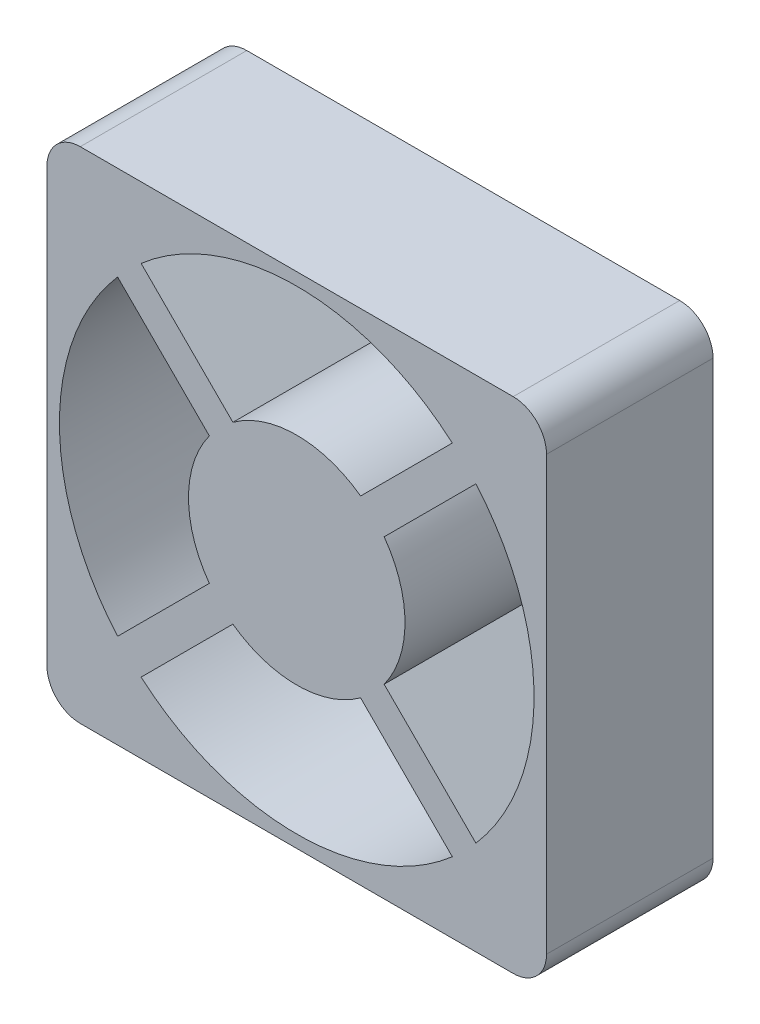
ISO-10303-21;
HEADER;
FILE_DESCRIPTION(('STEP AP214'),'2;1');
FILE_NAME('part.step','',(''),(''),'','','');
FILE_SCHEMA(('AUTOMOTIVE_DESIGN { 1 0 10303 214 1 1 1 1 }'));
ENDSEC;
DATA;
#1=APPLICATION_CONTEXT('core data for automotive mechanical design processes');
#2=APPLICATION_PROTOCOL_DEFINITION('international standard','automotive_design',2000,#1);
#3=PRODUCT_CONTEXT('',#1,'mechanical');
#4=PRODUCT('Part','Part','',(#3));
#5=PRODUCT_RELATED_PRODUCT_CATEGORY('part','',(#4));
#6=PRODUCT_DEFINITION_FORMATION('','',#4);
#7=PRODUCT_DEFINITION_CONTEXT('part definition',#1,'design');
#8=PRODUCT_DEFINITION('design','',#6,#7);
#9=PRODUCT_DEFINITION_SHAPE('','',#8);
#10=(LENGTH_UNIT() NAMED_UNIT(*) SI_UNIT(.MILLI.,.METRE.));
#11=(NAMED_UNIT(*) PLANE_ANGLE_UNIT() SI_UNIT($,.RADIAN.));
#12=(NAMED_UNIT(*) SI_UNIT($,.STERADIAN.) SOLID_ANGLE_UNIT());
#13=UNCERTAINTY_MEASURE_WITH_UNIT(LENGTH_MEASURE(1.E-05),#10,'distance_accuracy_value','');
#14=(GEOMETRIC_REPRESENTATION_CONTEXT(3) GLOBAL_UNCERTAINTY_ASSIGNED_CONTEXT((#13)) GLOBAL_UNIT_ASSIGNED_CONTEXT((#10,
#11,#12)) REPRESENTATION_CONTEXT('',''));
#15=CARTESIAN_POINT('',(0.,0.,0.));
#16=DIRECTION('',(0.,0.,1.));
#17=DIRECTION('',(1.,0.,0.));
#18=AXIS2_PLACEMENT_3D('',#15,#16,#17);
#19=CARTESIAN_POINT('',(0.,0.,10.));
#20=DIRECTION('',(0.,0.,-1.));
#21=DIRECTION('',(-1.,0.,0.));
#22=AXIS2_PLACEMENT_3D('',#19,#20,#21);
#23=CYLINDRICAL_SURFACE('',#22,14.25);
#24=CARTESIAN_POINT('',(0.,0.,0.));
#25=DIRECTION('',(0.,0.,1.));
#26=DIRECTION('',(1.,0.,0.));
#27=AXIS2_PLACEMENT_3D('',#24,#25,#26);
#28=CIRCLE('',#27,14.25);
#29=CARTESIAN_POINT('',(-10.7585370276739,9.34432346530076,0.));
#30=VERTEX_POINT('',#29);
#31=CARTESIAN_POINT('',(-10.7585370276739,-9.34432346530077,0.));
#32=VERTEX_POINT('',#31);
#33=EDGE_CURVE('E288',#30,#32,#28,.T.);
#34=ORIENTED_EDGE('',*,*,#33,.F.);
#35=DIRECTION('',(0.,0.,-1.));
#36=VECTOR('',#35,1.);
#37=CARTESIAN_POINT('',(-10.7585370276739,9.34432346530076,10.));
#38=LINE('',#37,#36);
#39=CARTESIAN_POINT('',(-10.7585370276739,9.34432346530076,10.));
#40=VERTEX_POINT('',#39);
#41=EDGE_CURVE('E233',#40,#30,#38,.T.);
#42=ORIENTED_EDGE('',*,*,#41,.F.);
#43=CARTESIAN_POINT('',(0.,0.,10.));
#44=DIRECTION('',(0.,0.,1.));
#45=DIRECTION('',(1.,0.,0.));
#46=AXIS2_PLACEMENT_3D('',#43,#44,#45);
#47=CIRCLE('',#46,14.25);
#48=CARTESIAN_POINT('',(-10.7585370276739,-9.34432346530077,10.));
#49=VERTEX_POINT('',#48);
#50=EDGE_CURVE('E467',#40,#49,#47,.T.);
#51=ORIENTED_EDGE('',*,*,#50,.T.);
#52=DIRECTION('',(0.,0.,-1.));
#53=VECTOR('',#52,1.);
#54=CARTESIAN_POINT('',(-10.7585370276739,-9.34432346530077,10.));
#55=LINE('',#54,#53);
#56=EDGE_CURVE('E304',#49,#32,#55,.T.);
#57=ORIENTED_EDGE('',*,*,#56,.T.);
#58=EDGE_LOOP('',(#34,#42,#51,#57));
#59=FACE_BOUND('',#58,.T.);
#60=ADVANCED_FACE('F33',(#59),#23,.F.);
#61=CARTESIAN_POINT('',(-0.707106781186549,-0.707106781186549,10.));
#62=DIRECTION('',(0.707106781186548,0.707106781186548,0.));
#63=DIRECTION('',(-0.707106781186548,0.707106781186548,0.));
#64=AXIS2_PLACEMENT_3D('',#61,#62,#63);
#65=PLANE('',#64);
#66=DIRECTION('',(0.707106781186548,-0.707106781186548,0.));
#67=VECTOR('',#66,1.);
#68=CARTESIAN_POINT('',(-0.707106781186549,-0.707106781186549,0.));
#69=LINE('',#68,#67);
#70=CARTESIAN_POINT('',(-5.24858231233279,3.83436874995969,0.));
#71=VERTEX_POINT('',#70);
#72=EDGE_CURVE('E296',#30,#71,#69,.T.);
#73=ORIENTED_EDGE('',*,*,#72,.T.);
#74=DIRECTION('',(0.,0.,-1.));
#75=VECTOR('',#74,1.);
#76=CARTESIAN_POINT('',(-5.24858231233279,3.83436874995969,10.));
#77=LINE('',#76,#75);
#78=CARTESIAN_POINT('',(-5.24858231233279,3.83436874995969,10.));
#79=VERTEX_POINT('',#78);
#80=EDGE_CURVE('E309',#79,#71,#77,.T.);
#81=ORIENTED_EDGE('',*,*,#80,.F.);
#82=DIRECTION('',(0.707106781186548,-0.707106781186548,0.));
#83=VECTOR('',#82,1.);
#84=CARTESIAN_POINT('',(-0.707106781186549,-0.707106781186549,10.));
#85=LINE('',#84,#83);
#86=EDGE_CURVE('E470',#40,#79,#85,.T.);
#87=ORIENTED_EDGE('',*,*,#86,.F.);
#88=ORIENTED_EDGE('',*,*,#41,.T.);
#89=EDGE_LOOP('',(#73,#81,#87,#88));
#90=FACE_BOUND('',#89,.T.);
#91=ADVANCED_FACE('F386',(#90),#65,.F.);
#92=CARTESIAN_POINT('',(0.,0.,10.));
#93=DIRECTION('',(0.,0.,-1.));
#94=DIRECTION('',(-1.,0.,0.));
#95=AXIS2_PLACEMENT_3D('',#92,#93,#94);
#96=CYLINDRICAL_SURFACE('',#95,6.5);
#97=CARTESIAN_POINT('',(0.,0.,0.));
#98=DIRECTION('',(0.,0.,1.));
#99=DIRECTION('',(1.,0.,0.));
#100=AXIS2_PLACEMENT_3D('',#97,#98,#99);
#101=CIRCLE('',#100,6.5);
#102=CARTESIAN_POINT('',(-5.24858231233279,-3.83436874995969,0.));
#103=VERTEX_POINT('',#102);
#104=EDGE_CURVE('E299',#71,#103,#101,.T.);
#105=ORIENTED_EDGE('',*,*,#104,.T.);
#106=DIRECTION('',(0.,0.,-1.));
#107=VECTOR('',#106,1.);
#108=CARTESIAN_POINT('',(-5.24858231233279,-3.83436874995969,10.));
#109=LINE('',#108,#107);
#110=CARTESIAN_POINT('',(-5.24858231233279,-3.83436874995969,10.));
#111=VERTEX_POINT('',#110);
#112=EDGE_CURVE('E306',#111,#103,#109,.T.);
#113=ORIENTED_EDGE('',*,*,#112,.F.);
#114=CARTESIAN_POINT('',(0.,0.,10.));
#115=DIRECTION('',(0.,0.,1.));
#116=DIRECTION('',(1.,0.,0.));
#117=AXIS2_PLACEMENT_3D('',#114,#115,#116);
#118=CIRCLE('',#117,6.5);
#119=EDGE_CURVE('E473',#79,#111,#118,.T.);
#120=ORIENTED_EDGE('',*,*,#119,.F.);
#121=ORIENTED_EDGE('',*,*,#80,.T.);
#122=EDGE_LOOP('',(#105,#113,#120,#121));
#123=FACE_BOUND('',#122,.T.);
#124=ADVANCED_FACE('F392',(#123),#96,.T.);
#125=CARTESIAN_POINT('',(15.,0.,10.));
#126=DIRECTION('',(1.,0.,0.));
#127=DIRECTION('',(0.,1.,0.));
#128=AXIS2_PLACEMENT_3D('',#125,#126,#127);
#129=PLANE('',#128);
#130=DIRECTION('',(0.,-1.,0.));
#131=VECTOR('',#130,1.);
#132=CARTESIAN_POINT('',(15.,0.,10.));
#133=LINE('',#132,#131);
#134=CARTESIAN_POINT('',(15.,13.,10.));
#135=VERTEX_POINT('',#134);
#136=CARTESIAN_POINT('',(15.,-13.,10.));
#137=VERTEX_POINT('',#136);
#138=EDGE_CURVE('E274',#135,#137,#133,.T.);
#139=ORIENTED_EDGE('',*,*,#138,.T.);
#140=DIRECTION('',(0.,0.,-1.));
#141=VECTOR('',#140,1.);
#142=CARTESIAN_POINT('',(15.,-13.,0.));
#143=LINE('',#142,#141);
#144=CARTESIAN_POINT('',(15.,-13.,0.));
#145=VERTEX_POINT('',#144);
#146=EDGE_CURVE('E232',#137,#145,#143,.T.);
#147=ORIENTED_EDGE('',*,*,#146,.T.);
#148=DIRECTION('',(0.,-1.,0.));
#149=VECTOR('',#148,1.);
#150=CARTESIAN_POINT('',(15.,0.,0.));
#151=LINE('',#150,#149);
#152=CARTESIAN_POINT('',(15.,13.,0.));
#153=VERTEX_POINT('',#152);
#154=EDGE_CURVE('E290',#153,#145,#151,.T.);
#155=ORIENTED_EDGE('',*,*,#154,.F.);
#156=DIRECTION('',(0.,0.,-1.));
#157=VECTOR('',#156,1.);
#158=CARTESIAN_POINT('',(15.,13.,10.));
#159=LINE('',#158,#157);
#160=EDGE_CURVE('E230',#153,#135,#159,.F.);
#161=ORIENTED_EDGE('',*,*,#160,.T.);
#162=EDGE_LOOP('',(#139,#147,#155,#161));
#163=FACE_BOUND('',#162,.T.);
#164=ADVANCED_FACE('F372',(#163),#129,.T.);
#165=CARTESIAN_POINT('',(0.,15.,10.));
#166=DIRECTION('',(0.,1.,0.));
#167=DIRECTION('',(0.,0.,1.));
#168=AXIS2_PLACEMENT_3D('',#165,#166,#167);
#169=PLANE('',#168);
#170=DIRECTION('',(1.,0.,0.));
#171=VECTOR('',#170,1.);
#172=CARTESIAN_POINT('',(0.,15.,10.));
#173=LINE('',#172,#171);
#174=CARTESIAN_POINT('',(-13.,15.,10.));
#175=VERTEX_POINT('',#174);
#176=CARTESIAN_POINT('',(13.,15.,10.));
#177=VERTEX_POINT('',#176);
#178=EDGE_CURVE('E264',#175,#177,#173,.T.);
#179=ORIENTED_EDGE('',*,*,#178,.T.);
#180=DIRECTION('',(0.,0.,-1.));
#181=VECTOR('',#180,1.);
#182=CARTESIAN_POINT('',(13.,15.,10.));
#183=LINE('',#182,#181);
#184=CARTESIAN_POINT('',(13.,15.,0.));
#185=VERTEX_POINT('',#184);
#186=EDGE_CURVE('E11',#177,#185,#183,.T.);
#187=ORIENTED_EDGE('',*,*,#186,.T.);
#188=DIRECTION('',(1.,0.,0.));
#189=VECTOR('',#188,1.);
#190=CARTESIAN_POINT('',(0.,15.,0.));
#191=LINE('',#190,#189);
#192=CARTESIAN_POINT('',(-13.,15.,0.));
#193=VERTEX_POINT('',#192);
#194=EDGE_CURVE('E267',#193,#185,#191,.T.);
#195=ORIENTED_EDGE('',*,*,#194,.F.);
#196=DIRECTION('',(0.,0.,-1.));
#197=VECTOR('',#196,1.);
#198=CARTESIAN_POINT('',(-13.,15.,10.));
#199=LINE('',#198,#197);
#200=EDGE_CURVE('E41',#193,#175,#199,.F.);
#201=ORIENTED_EDGE('',*,*,#200,.T.);
#202=EDGE_LOOP('',(#179,#187,#195,#201));
#203=FACE_BOUND('',#202,.T.);
#204=ADVANCED_FACE('F263',(#203),#169,.T.);
#205=CARTESIAN_POINT('',(-15.,0.,10.));
#206=DIRECTION('',(1.,0.,0.));
#207=DIRECTION('',(0.,1.,0.));
#208=AXIS2_PLACEMENT_3D('',#205,#206,#207);
#209=PLANE('',#208);
#210=DIRECTION('',(0.,-1.,0.));
#211=VECTOR('',#210,1.);
#212=CARTESIAN_POINT('',(-15.,0.,0.));
#213=LINE('',#212,#211);
#214=CARTESIAN_POINT('',(-15.,13.,0.));
#215=VERTEX_POINT('',#214);
#216=CARTESIAN_POINT('',(-15.,-13.,0.));
#217=VERTEX_POINT('',#216);
#218=EDGE_CURVE('E279',#215,#217,#213,.T.);
#219=ORIENTED_EDGE('',*,*,#218,.T.);
#220=DIRECTION('',(0.,0.,-1.));
#221=VECTOR('',#220,1.);
#222=CARTESIAN_POINT('',(-15.,-13.,10.));
#223=LINE('',#222,#221);
#224=CARTESIAN_POINT('',(-15.,-13.,10.));
#225=VERTEX_POINT('',#224);
#226=EDGE_CURVE('E48',#217,#225,#223,.F.);
#227=ORIENTED_EDGE('',*,*,#226,.T.);
#228=DIRECTION('',(0.,-1.,0.));
#229=VECTOR('',#228,1.);
#230=CARTESIAN_POINT('',(-15.,0.,10.));
#231=LINE('',#230,#229);
#232=CARTESIAN_POINT('',(-15.,13.,10.));
#233=VERTEX_POINT('',#232);
#234=EDGE_CURVE('E273',#233,#225,#231,.T.);
#235=ORIENTED_EDGE('',*,*,#234,.F.);
#236=DIRECTION('',(0.,0.,-1.));
#237=VECTOR('',#236,1.);
#238=CARTESIAN_POINT('',(-15.,13.,0.));
#239=LINE('',#238,#237);
#240=EDGE_CURVE('E256',#233,#215,#239,.T.);
#241=ORIENTED_EDGE('',*,*,#240,.T.);
#242=EDGE_LOOP('',(#219,#227,#235,#241));
#243=FACE_BOUND('',#242,.T.);
#244=ADVANCED_FACE('F278',(#243),#209,.F.);
#245=CARTESIAN_POINT('',(0.,0.,10.));
#246=DIRECTION('',(0.,0.,-1.));
#247=DIRECTION('',(-1.,0.,0.));
#248=AXIS2_PLACEMENT_3D('',#245,#246,#247);
#249=CYLINDRICAL_SURFACE('',#248,6.5);
#250=CARTESIAN_POINT('',(0.,0.,0.));
#251=DIRECTION('',(0.,0.,1.));
#252=DIRECTION('',(1.,0.,0.));
#253=AXIS2_PLACEMENT_3D('',#250,#251,#252);
#254=CIRCLE('',#253,6.5);
#255=CARTESIAN_POINT('',(-3.83436874995969,-5.24858231233279,0.));
#256=VERTEX_POINT('',#255);
#257=CARTESIAN_POINT('',(3.83436874995969,-5.24858231233279,0.));
#258=VERTEX_POINT('',#257);
#259=EDGE_CURVE('E358',#256,#258,#254,.T.);
#260=ORIENTED_EDGE('',*,*,#259,.T.);
#261=DIRECTION('',(0.,0.,-1.));
#262=VECTOR('',#261,1.);
#263=CARTESIAN_POINT('',(3.83436874995969,-5.24858231233279,10.));
#264=LINE('',#263,#262);
#265=CARTESIAN_POINT('',(3.83436874995969,-5.24858231233279,10.));
#266=VERTEX_POINT('',#265);
#267=EDGE_CURVE('E307',#266,#258,#264,.T.);
#268=ORIENTED_EDGE('',*,*,#267,.F.);
#269=CARTESIAN_POINT('',(0.,0.,10.));
#270=DIRECTION('',(0.,0.,1.));
#271=DIRECTION('',(1.,0.,0.));
#272=AXIS2_PLACEMENT_3D('',#269,#270,#271);
#273=CIRCLE('',#272,6.5);
#274=CARTESIAN_POINT('',(-3.83436874995969,-5.24858231233279,10.));
#275=VERTEX_POINT('',#274);
#276=EDGE_CURVE('E737',#275,#266,#273,.T.);
#277=ORIENTED_EDGE('',*,*,#276,.F.);
#278=DIRECTION('',(0.,0.,-1.));
#279=VECTOR('',#278,1.);
#280=CARTESIAN_POINT('',(-3.83436874995969,-5.24858231233279,10.));
#281=LINE('',#280,#279);
#282=EDGE_CURVE('E313',#275,#256,#281,.T.);
#283=ORIENTED_EDGE('',*,*,#282,.T.);
#284=EDGE_LOOP('',(#260,#268,#277,#283));
#285=FACE_BOUND('',#284,.T.);
#286=ADVANCED_FACE('F405',(#285),#249,.T.);
#287=CARTESIAN_POINT('',(-0.707106781186549,-0.707106781186549,10.));
#288=DIRECTION('',(0.707106781186548,0.707106781186548,0.));
#289=DIRECTION('',(-0.707106781186548,0.707106781186548,0.));
#290=AXIS2_PLACEMENT_3D('',#287,#288,#289);
#291=PLANE('',#290);
#292=DIRECTION('',(0.707106781186548,-0.707106781186548,0.));
#293=VECTOR('',#292,1.);
#294=CARTESIAN_POINT('',(-0.707106781186549,-0.707106781186549,0.));
#295=LINE('',#294,#293);
#296=CARTESIAN_POINT('',(9.34432346530076,-10.7585370276739,0.));
#297=VERTEX_POINT('',#296);
#298=EDGE_CURVE('E361',#258,#297,#295,.T.);
#299=ORIENTED_EDGE('',*,*,#298,.T.);
#300=DIRECTION('',(0.,0.,-1.));
#301=VECTOR('',#300,1.);
#302=CARTESIAN_POINT('',(9.34432346530076,-10.7585370276739,10.));
#303=LINE('',#302,#301);
#304=CARTESIAN_POINT('',(9.34432346530076,-10.7585370276739,10.));
#305=VERTEX_POINT('',#304);
#306=EDGE_CURVE('E319',#305,#297,#303,.T.);
#307=ORIENTED_EDGE('',*,*,#306,.F.);
#308=DIRECTION('',(0.707106781186548,-0.707106781186548,0.));
#309=VECTOR('',#308,1.);
#310=CARTESIAN_POINT('',(-0.707106781186549,-0.707106781186549,10.));
#311=LINE('',#310,#309);
#312=EDGE_CURVE('E735',#266,#305,#311,.T.);
#313=ORIENTED_EDGE('',*,*,#312,.F.);
#314=ORIENTED_EDGE('',*,*,#267,.T.);
#315=EDGE_LOOP('',(#299,#307,#313,#314));
#316=FACE_BOUND('',#315,.T.);
#317=ADVANCED_FACE('F418',(#316),#291,.F.);
#318=CARTESIAN_POINT('',(0.,0.,10.));
#319=DIRECTION('',(0.,0.,-1.));
#320=DIRECTION('',(-1.,0.,0.));
#321=AXIS2_PLACEMENT_3D('',#318,#319,#320);
#322=CYLINDRICAL_SURFACE('',#321,14.25);
#323=CARTESIAN_POINT('',(0.,0.,0.));
#324=DIRECTION('',(0.,0.,1.));
#325=DIRECTION('',(1.,0.,0.));
#326=AXIS2_PLACEMENT_3D('',#323,#324,#325);
#327=CIRCLE('',#326,14.25);
#328=CARTESIAN_POINT('',(-9.34432346530077,-10.7585370276739,0.));
#329=VERTEX_POINT('',#328);
#330=EDGE_CURVE('E364',#329,#297,#327,.T.);
#331=ORIENTED_EDGE('',*,*,#330,.F.);
#332=DIRECTION('',(0.,0.,-1.));
#333=VECTOR('',#332,1.);
#334=CARTESIAN_POINT('',(-9.34432346530077,-10.7585370276739,10.));
#335=LINE('',#334,#333);
#336=CARTESIAN_POINT('',(-9.34432346530077,-10.7585370276739,10.));
#337=VERTEX_POINT('',#336);
#338=EDGE_CURVE('E316',#337,#329,#335,.T.);
#339=ORIENTED_EDGE('',*,*,#338,.F.);
#340=CARTESIAN_POINT('',(0.,0.,10.));
#341=DIRECTION('',(0.,0.,1.));
#342=DIRECTION('',(1.,0.,0.));
#343=AXIS2_PLACEMENT_3D('',#340,#341,#342);
#344=CIRCLE('',#343,14.25);
#345=EDGE_CURVE('E461',#337,#305,#344,.T.);
#346=ORIENTED_EDGE('',*,*,#345,.T.);
#347=ORIENTED_EDGE('',*,*,#306,.T.);
#348=EDGE_LOOP('',(#331,#339,#346,#347));
#349=FACE_BOUND('',#348,.T.);
#350=ADVANCED_FACE('F414',(#349),#322,.F.);
#351=CARTESIAN_POINT('',(-0.707106781186548,0.707106781186548,10.));
#352=DIRECTION('',(-0.707106781186548,0.707106781186548,0.));
#353=DIRECTION('',(-0.707106781186548,-0.707106781186548,0.));
#354=AXIS2_PLACEMENT_3D('',#351,#352,#353);
#355=PLANE('',#354);
#356=DIRECTION('',(0.707106781186548,0.707106781186548,0.));
#357=VECTOR('',#356,1.);
#358=CARTESIAN_POINT('',(-0.707106781186548,0.707106781186548,0.));
#359=LINE('',#358,#357);
#360=CARTESIAN_POINT('',(3.83436874995969,5.24858231233278,0.));
#361=VERTEX_POINT('',#360);
#362=CARTESIAN_POINT('',(9.34432346530076,10.7585370276739,0.));
#363=VERTEX_POINT('',#362);
#364=EDGE_CURVE('E343',#361,#363,#359,.T.);
#365=ORIENTED_EDGE('',*,*,#364,.F.);
#366=DIRECTION('',(0.,0.,-1.));
#367=VECTOR('',#366,1.);
#368=CARTESIAN_POINT('',(3.83436874995969,5.24858231233278,10.));
#369=LINE('',#368,#367);
#370=CARTESIAN_POINT('',(3.83436874995969,5.24858231233278,10.));
#371=VERTEX_POINT('',#370);
#372=EDGE_CURVE('E317',#371,#361,#369,.T.);
#373=ORIENTED_EDGE('',*,*,#372,.F.);
#374=DIRECTION('',(0.707106781186548,0.707106781186548,0.));
#375=VECTOR('',#374,1.);
#376=CARTESIAN_POINT('',(-0.707106781186548,0.707106781186548,10.));
#377=LINE('',#376,#375);
#378=CARTESIAN_POINT('',(9.34432346530076,10.7585370276739,10.));
#379=VERTEX_POINT('',#378);
#380=EDGE_CURVE('E748',#371,#379,#377,.T.);
#381=ORIENTED_EDGE('',*,*,#380,.T.);
#382=DIRECTION('',(0.,0.,-1.));
#383=VECTOR('',#382,1.);
#384=CARTESIAN_POINT('',(9.34432346530076,10.7585370276739,10.));
#385=LINE('',#384,#383);
#386=EDGE_CURVE('E222',#379,#363,#385,.T.);
#387=ORIENTED_EDGE('',*,*,#386,.T.);
#388=EDGE_LOOP('',(#365,#373,#381,#387));
#389=FACE_BOUND('',#388,.T.);
#390=ADVANCED_FACE('F417',(#389),#355,.T.);
#391=CARTESIAN_POINT('',(0.,0.,10.));
#392=DIRECTION('',(0.,0.,-1.));
#393=DIRECTION('',(-1.,0.,0.));
#394=AXIS2_PLACEMENT_3D('',#391,#392,#393);
#395=CYLINDRICAL_SURFACE('',#394,6.5);
#396=CARTESIAN_POINT('',(0.,0.,0.));
#397=DIRECTION('',(0.,0.,1.));
#398=DIRECTION('',(1.,0.,0.));
#399=AXIS2_PLACEMENT_3D('',#396,#397,#398);
#400=CIRCLE('',#399,6.5);
#401=CARTESIAN_POINT('',(-3.83436874995969,5.24858231233279,0.));
#402=VERTEX_POINT('',#401);
#403=EDGE_CURVE('E346',#361,#402,#400,.T.);
#404=ORIENTED_EDGE('',*,*,#403,.T.);
#405=DIRECTION('',(0.,0.,-1.));
#406=VECTOR('',#405,1.);
#407=CARTESIAN_POINT('',(-3.83436874995969,5.24858231233279,10.));
#408=LINE('',#407,#406);
#409=CARTESIAN_POINT('',(-3.83436874995969,5.24858231233279,10.));
#410=VERTEX_POINT('',#409);
#411=EDGE_CURVE('E324',#410,#402,#408,.T.);
#412=ORIENTED_EDGE('',*,*,#411,.F.);
#413=CARTESIAN_POINT('',(0.,0.,10.));
#414=DIRECTION('',(0.,0.,1.));
#415=DIRECTION('',(1.,0.,0.));
#416=AXIS2_PLACEMENT_3D('',#413,#414,#415);
#417=CIRCLE('',#416,6.5);
#418=EDGE_CURVE('E746',#371,#410,#417,.T.);
#419=ORIENTED_EDGE('',*,*,#418,.F.);
#420=ORIENTED_EDGE('',*,*,#372,.T.);
#421=EDGE_LOOP('',(#404,#412,#419,#420));
#422=FACE_BOUND('',#421,.T.);
#423=ADVANCED_FACE('F432',(#422),#395,.T.);
#424=CARTESIAN_POINT('',(0.707106781186547,0.707106781186547,10.));
#425=DIRECTION('',(0.707106781186548,0.707106781186548,0.));
#426=DIRECTION('',(-0.707106781186548,0.707106781186548,0.));
#427=AXIS2_PLACEMENT_3D('',#424,#425,#426);
#428=PLANE('',#427);
#429=DIRECTION('',(0.707106781186548,-0.707106781186548,0.));
#430=VECTOR('',#429,1.);
#431=CARTESIAN_POINT('',(0.707106781186547,0.707106781186547,0.));
#432=LINE('',#431,#430);
#433=CARTESIAN_POINT('',(-9.34432346530077,10.7585370276739,0.));
#434=VERTEX_POINT('',#433);
#435=EDGE_CURVE('E352',#434,#402,#432,.T.);
#436=ORIENTED_EDGE('',*,*,#435,.F.);
#437=DIRECTION('',(0.,0.,-1.));
#438=VECTOR('',#437,1.);
#439=CARTESIAN_POINT('',(-9.34432346530077,10.7585370276739,10.));
#440=LINE('',#439,#438);
#441=CARTESIAN_POINT('',(-9.34432346530077,10.7585370276739,10.));
#442=VERTEX_POINT('',#441);
#443=EDGE_CURVE('E224',#442,#434,#440,.T.);
#444=ORIENTED_EDGE('',*,*,#443,.F.);
#445=DIRECTION('',(0.707106781186548,-0.707106781186548,0.));
#446=VECTOR('',#445,1.);
#447=CARTESIAN_POINT('',(0.707106781186547,0.707106781186547,10.));
#448=LINE('',#447,#446);
#449=EDGE_CURVE('E743',#442,#410,#448,.T.);
#450=ORIENTED_EDGE('',*,*,#449,.T.);
#451=ORIENTED_EDGE('',*,*,#411,.T.);
#452=EDGE_LOOP('',(#436,#444,#450,#451));
#453=FACE_BOUND('',#452,.T.);
#454=ADVANCED_FACE('F429',(#453),#428,.T.);
#455=CARTESIAN_POINT('',(0.,0.,10.));
#456=DIRECTION('',(0.,0.,-1.));
#457=DIRECTION('',(-1.,0.,0.));
#458=AXIS2_PLACEMENT_3D('',#455,#456,#457);
#459=CYLINDRICAL_SURFACE('',#458,6.5);
#460=CARTESIAN_POINT('',(0.,0.,0.));
#461=DIRECTION('',(0.,0.,1.));
#462=DIRECTION('',(1.,0.,0.));
#463=AXIS2_PLACEMENT_3D('',#460,#461,#462);
#464=CIRCLE('',#463,6.5);
#465=CARTESIAN_POINT('',(5.24858231233278,-3.83436874995969,0.));
#466=VERTEX_POINT('',#465);
#467=CARTESIAN_POINT('',(5.24858231233278,3.83436874995969,0.));
#468=VERTEX_POINT('',#467);
#469=EDGE_CURVE('E221',#466,#468,#464,.T.);
#470=ORIENTED_EDGE('',*,*,#469,.T.);
#471=DIRECTION('',(0.,0.,-1.));
#472=VECTOR('',#471,1.);
#473=CARTESIAN_POINT('',(5.24858231233278,3.83436874995969,10.));
#474=LINE('',#473,#472);
#475=CARTESIAN_POINT('',(5.24858231233278,3.83436874995969,10.));
#476=VERTEX_POINT('',#475);
#477=EDGE_CURVE('E201',#476,#468,#474,.T.);
#478=ORIENTED_EDGE('',*,*,#477,.F.);
#479=CARTESIAN_POINT('',(0.,0.,10.));
#480=DIRECTION('',(0.,0.,1.));
#481=DIRECTION('',(1.,0.,0.));
#482=AXIS2_PLACEMENT_3D('',#479,#480,#481);
#483=CIRCLE('',#482,6.5);
#484=CARTESIAN_POINT('',(5.24858231233278,-3.83436874995969,10.));
#485=VERTEX_POINT('',#484);
#486=EDGE_CURVE('E208',#485,#476,#483,.T.);
#487=ORIENTED_EDGE('',*,*,#486,.F.);
#488=DIRECTION('',(0.,0.,-1.));
#489=VECTOR('',#488,1.);
#490=CARTESIAN_POINT('',(5.24858231233278,-3.83436874995969,10.));
#491=LINE('',#490,#489);
#492=EDGE_CURVE('E327',#485,#466,#491,.T.);
#493=ORIENTED_EDGE('',*,*,#492,.T.);
#494=EDGE_LOOP('',(#470,#478,#487,#493));
#495=FACE_BOUND('',#494,.T.);
#496=ADVANCED_FACE('F219',(#495),#459,.T.);
#497=CARTESIAN_POINT('',(0.707106781186547,-0.707106781186547,10.));
#498=DIRECTION('',(-0.707106781186548,0.707106781186548,0.));
#499=DIRECTION('',(-0.707106781186548,-0.707106781186548,0.));
#500=AXIS2_PLACEMENT_3D('',#497,#498,#499);
#501=PLANE('',#500);
#502=DIRECTION('',(0.707106781186548,0.707106781186548,0.));
#503=VECTOR('',#502,1.);
#504=CARTESIAN_POINT('',(0.707106781186547,-0.707106781186547,0.));
#505=LINE('',#504,#503);
#506=CARTESIAN_POINT('',(10.7585370276739,9.34432346530076,0.));
#507=VERTEX_POINT('',#506);
#508=EDGE_CURVE('E340',#468,#507,#505,.T.);
#509=ORIENTED_EDGE('',*,*,#508,.T.);
#510=DIRECTION('',(0.,0.,-1.));
#511=VECTOR('',#510,1.);
#512=CARTESIAN_POINT('',(10.7585370276739,9.34432346530076,10.));
#513=LINE('',#512,#511);
#514=CARTESIAN_POINT('',(10.7585370276739,9.34432346530076,10.));
#515=VERTEX_POINT('',#514);
#516=EDGE_CURVE('E203',#515,#507,#513,.T.);
#517=ORIENTED_EDGE('',*,*,#516,.F.);
#518=DIRECTION('',(0.707106781186548,0.707106781186548,0.));
#519=VECTOR('',#518,1.);
#520=CARTESIAN_POINT('',(0.707106781186547,-0.707106781186547,10.));
#521=LINE('',#520,#519);
#522=EDGE_CURVE('E196',#476,#515,#521,.T.);
#523=ORIENTED_EDGE('',*,*,#522,.F.);
#524=ORIENTED_EDGE('',*,*,#477,.T.);
#525=EDGE_LOOP('',(#509,#517,#523,#524));
#526=FACE_BOUND('',#525,.T.);
#527=ADVANCED_FACE('F199',(#526),#501,.F.);
#528=CARTESIAN_POINT('',(0.,0.,10.));
#529=DIRECTION('',(0.,0.,-1.));
#530=DIRECTION('',(-1.,0.,0.));
#531=AXIS2_PLACEMENT_3D('',#528,#529,#530);
#532=CYLINDRICAL_SURFACE('',#531,14.25);
#533=CARTESIAN_POINT('',(0.,0.,0.));
#534=DIRECTION('',(0.,0.,1.));
#535=DIRECTION('',(1.,0.,0.));
#536=AXIS2_PLACEMENT_3D('',#533,#534,#535);
#537=CIRCLE('',#536,14.25);
#538=CARTESIAN_POINT('',(10.7585370276739,-9.34432346530076,0.));
#539=VERTEX_POINT('',#538);
#540=EDGE_CURVE('E337',#539,#507,#537,.T.);
#541=ORIENTED_EDGE('',*,*,#540,.F.);
#542=DIRECTION('',(0.,0.,-1.));
#543=VECTOR('',#542,1.);
#544=CARTESIAN_POINT('',(10.7585370276739,-9.34432346530076,10.));
#545=LINE('',#544,#543);
#546=CARTESIAN_POINT('',(10.7585370276739,-9.34432346530076,10.));
#547=VERTEX_POINT('',#546);
#548=EDGE_CURVE('E226',#547,#539,#545,.T.);
#549=ORIENTED_EDGE('',*,*,#548,.F.);
#550=CARTESIAN_POINT('',(0.,0.,10.));
#551=DIRECTION('',(0.,0.,1.));
#552=DIRECTION('',(1.,0.,0.));
#553=AXIS2_PLACEMENT_3D('',#550,#551,#552);
#554=CIRCLE('',#553,14.25);
#555=EDGE_CURVE('E207',#547,#515,#554,.T.);
#556=ORIENTED_EDGE('',*,*,#555,.T.);
#557=ORIENTED_EDGE('',*,*,#516,.T.);
#558=EDGE_LOOP('',(#541,#549,#556,#557));
#559=FACE_BOUND('',#558,.T.);
#560=ADVANCED_FACE('F338',(#559),#532,.F.);
#561=CARTESIAN_POINT('',(0.,-15.,10.));
#562=DIRECTION('',(0.,1.,0.));
#563=DIRECTION('',(0.,0.,1.));
#564=AXIS2_PLACEMENT_3D('',#561,#562,#563);
#565=PLANE('',#564);
#566=DIRECTION('',(1.,0.,0.));
#567=VECTOR('',#566,1.);
#568=CARTESIAN_POINT('',(0.,-15.,0.));
#569=LINE('',#568,#567);
#570=CARTESIAN_POINT('',(-13.,-15.,0.));
#571=VERTEX_POINT('',#570);
#572=CARTESIAN_POINT('',(13.,-15.,0.));
#573=VERTEX_POINT('',#572);
#574=EDGE_CURVE('E285',#571,#573,#569,.T.);
#575=ORIENTED_EDGE('',*,*,#574,.T.);
#576=DIRECTION('',(0.,0.,-1.));
#577=VECTOR('',#576,1.);
#578=CARTESIAN_POINT('',(13.,-15.,10.));
#579=LINE('',#578,#577);
#580=CARTESIAN_POINT('',(13.,-15.,10.));
#581=VERTEX_POINT('',#580);
#582=EDGE_CURVE('E247',#573,#581,#579,.F.);
#583=ORIENTED_EDGE('',*,*,#582,.T.);
#584=DIRECTION('',(1.,0.,0.));
#585=VECTOR('',#584,1.);
#586=CARTESIAN_POINT('',(0.,-15.,10.));
#587=LINE('',#586,#585);
#588=CARTESIAN_POINT('',(-13.,-15.,10.));
#589=VERTEX_POINT('',#588);
#590=EDGE_CURVE('E458',#589,#581,#587,.T.);
#591=ORIENTED_EDGE('',*,*,#590,.F.);
#592=DIRECTION('',(0.,0.,-1.));
#593=VECTOR('',#592,1.);
#594=CARTESIAN_POINT('',(-13.,-15.,10.));
#595=LINE('',#594,#593);
#596=EDGE_CURVE('E244',#589,#571,#595,.T.);
#597=ORIENTED_EDGE('',*,*,#596,.T.);
#598=EDGE_LOOP('',(#575,#583,#591,#597));
#599=FACE_BOUND('',#598,.T.);
#600=ADVANCED_FACE('F398',(#599),#565,.F.);
#601=CARTESIAN_POINT('',(0.707106781186547,-0.707106781186547,10.));
#602=DIRECTION('',(-0.707106781186548,0.707106781186548,0.));
#603=DIRECTION('',(-0.707106781186548,-0.707106781186548,0.));
#604=AXIS2_PLACEMENT_3D('',#601,#602,#603);
#605=PLANE('',#604);
#606=DIRECTION('',(0.707106781186548,0.707106781186548,0.));
#607=VECTOR('',#606,1.);
#608=CARTESIAN_POINT('',(0.707106781186547,-0.707106781186547,0.));
#609=LINE('',#608,#607);
#610=EDGE_CURVE('E367',#329,#256,#609,.T.);
#611=ORIENTED_EDGE('',*,*,#610,.T.);
#612=ORIENTED_EDGE('',*,*,#282,.F.);
#613=DIRECTION('',(0.707106781186548,0.707106781186548,0.));
#614=VECTOR('',#613,1.);
#615=CARTESIAN_POINT('',(0.707106781186547,-0.707106781186547,10.));
#616=LINE('',#615,#614);
#617=EDGE_CURVE('E459',#337,#275,#616,.T.);
#618=ORIENTED_EDGE('',*,*,#617,.F.);
#619=ORIENTED_EDGE('',*,*,#338,.T.);
#620=EDGE_LOOP('',(#611,#612,#618,#619));
#621=FACE_BOUND('',#620,.T.);
#622=ADVANCED_FACE('F401',(#621),#605,.F.);
#623=CARTESIAN_POINT('',(0.,0.,10.));
#624=DIRECTION('',(0.,0.,-1.));
#625=DIRECTION('',(-1.,0.,0.));
#626=AXIS2_PLACEMENT_3D('',#623,#624,#625);
#627=CYLINDRICAL_SURFACE('',#626,14.25);
#628=CARTESIAN_POINT('',(0.,0.,0.));
#629=DIRECTION('',(0.,0.,1.));
#630=DIRECTION('',(1.,0.,0.));
#631=AXIS2_PLACEMENT_3D('',#628,#629,#630);
#632=CIRCLE('',#631,14.25);
#633=EDGE_CURVE('E355',#363,#434,#632,.T.);
#634=ORIENTED_EDGE('',*,*,#633,.F.);
#635=ORIENTED_EDGE('',*,*,#386,.F.);
#636=CARTESIAN_POINT('',(0.,0.,10.));
#637=DIRECTION('',(0.,0.,1.));
#638=DIRECTION('',(1.,0.,0.));
#639=AXIS2_PLACEMENT_3D('',#636,#637,#638);
#640=CIRCLE('',#639,14.25);
#641=EDGE_CURVE('E740',#379,#442,#640,.T.);
#642=ORIENTED_EDGE('',*,*,#641,.T.);
#643=ORIENTED_EDGE('',*,*,#443,.T.);
#644=EDGE_LOOP('',(#634,#635,#642,#643));
#645=FACE_BOUND('',#644,.T.);
#646=ADVANCED_FACE('F412',(#645),#627,.F.);
#647=CARTESIAN_POINT('',(0.707106781186547,0.707106781186547,10.));
#648=DIRECTION('',(0.707106781186548,0.707106781186548,0.));
#649=DIRECTION('',(-0.707106781186548,0.707106781186548,0.));
#650=AXIS2_PLACEMENT_3D('',#647,#648,#649);
#651=PLANE('',#650);
#652=DIRECTION('',(0.707106781186548,-0.707106781186548,0.));
#653=VECTOR('',#652,1.);
#654=CARTESIAN_POINT('',(0.707106781186547,0.707106781186547,0.));
#655=LINE('',#654,#653);
#656=EDGE_CURVE('E334',#466,#539,#655,.T.);
#657=ORIENTED_EDGE('',*,*,#656,.F.);
#658=ORIENTED_EDGE('',*,*,#492,.F.);
#659=DIRECTION('',(0.707106781186548,-0.707106781186548,0.));
#660=VECTOR('',#659,1.);
#661=CARTESIAN_POINT('',(0.707106781186547,0.707106781186547,10.));
#662=LINE('',#661,#660);
#663=EDGE_CURVE('E215',#485,#547,#662,.T.);
#664=ORIENTED_EDGE('',*,*,#663,.T.);
#665=ORIENTED_EDGE('',*,*,#548,.T.);
#666=EDGE_LOOP('',(#657,#658,#664,#665));
#667=FACE_BOUND('',#666,.T.);
#668=ADVANCED_FACE('F332',(#667),#651,.T.);
#669=CARTESIAN_POINT('',(-0.707106781186548,0.707106781186548,10.));
#670=DIRECTION('',(-0.707106781186548,0.707106781186548,0.));
#671=DIRECTION('',(-0.707106781186548,-0.707106781186548,0.));
#672=AXIS2_PLACEMENT_3D('',#669,#670,#671);
#673=PLANE('',#672);
#674=DIRECTION('',(0.707106781186548,0.707106781186548,0.));
#675=VECTOR('',#674,1.);
#676=CARTESIAN_POINT('',(-0.707106781186548,0.707106781186548,0.));
#677=LINE('',#676,#675);
#678=EDGE_CURVE('E217',#32,#103,#677,.T.);
#679=ORIENTED_EDGE('',*,*,#678,.F.);
#680=ORIENTED_EDGE('',*,*,#56,.F.);
#681=DIRECTION('',(0.707106781186548,0.707106781186548,0.));
#682=VECTOR('',#681,1.);
#683=CARTESIAN_POINT('',(-0.707106781186548,0.707106781186548,10.));
#684=LINE('',#683,#682);
#685=EDGE_CURVE('E328',#49,#111,#684,.T.);
#686=ORIENTED_EDGE('',*,*,#685,.T.);
#687=ORIENTED_EDGE('',*,*,#112,.T.);
#688=EDGE_LOOP('',(#679,#680,#686,#687));
#689=FACE_BOUND('',#688,.T.);
#690=ADVANCED_FACE('F442',(#689),#673,.T.);
#691=CARTESIAN_POINT('',(0.,0.,10.));
#692=DIRECTION('',(0.,0.,1.));
#693=DIRECTION('',(1.,0.,0.));
#694=AXIS2_PLACEMENT_3D('',#691,#692,#693);
#695=PLANE('',#694);
#696=ORIENTED_EDGE('',*,*,#486,.T.);
#697=ORIENTED_EDGE('',*,*,#522,.T.);
#698=ORIENTED_EDGE('',*,*,#555,.F.);
#699=ORIENTED_EDGE('',*,*,#663,.F.);
#700=EDGE_LOOP('',(#696,#697,#698,#699));
#701=FACE_BOUND('',#700,.T.);
#702=ORIENTED_EDGE('',*,*,#380,.F.);
#703=ORIENTED_EDGE('',*,*,#418,.T.);
#704=ORIENTED_EDGE('',*,*,#449,.F.);
#705=ORIENTED_EDGE('',*,*,#641,.F.);
#706=EDGE_LOOP('',(#702,#703,#704,#705));
#707=FACE_BOUND('',#706,.T.);
#708=ORIENTED_EDGE('',*,*,#276,.T.);
#709=ORIENTED_EDGE('',*,*,#312,.T.);
#710=ORIENTED_EDGE('',*,*,#345,.F.);
#711=ORIENTED_EDGE('',*,*,#617,.T.);
#712=EDGE_LOOP('',(#708,#709,#710,#711));
#713=FACE_BOUND('',#712,.T.);
#714=ORIENTED_EDGE('',*,*,#590,.T.);
#715=CARTESIAN_POINT('',(13.,-13.,10.));
#716=DIRECTION('',(0.,0.,1.));
#717=DIRECTION('',(1.,0.,0.));
#718=AXIS2_PLACEMENT_3D('',#715,#716,#717);
#719=CIRCLE('',#718,2.);
#720=EDGE_CURVE('E254',#581,#137,#719,.T.);
#721=ORIENTED_EDGE('',*,*,#720,.T.);
#722=ORIENTED_EDGE('',*,*,#138,.F.);
#723=CARTESIAN_POINT('',(13.,13.,10.));
#724=DIRECTION('',(0.,0.,1.));
#725=DIRECTION('',(1.,0.,0.));
#726=AXIS2_PLACEMENT_3D('',#723,#724,#725);
#727=CIRCLE('',#726,2.);
#728=EDGE_CURVE('E250',#135,#177,#727,.T.);
#729=ORIENTED_EDGE('',*,*,#728,.T.);
#730=ORIENTED_EDGE('',*,*,#178,.F.);
#731=CARTESIAN_POINT('',(-13.,13.,10.));
#732=DIRECTION('',(0.,0.,1.));
#733=DIRECTION('',(1.,0.,0.));
#734=AXIS2_PLACEMENT_3D('',#731,#732,#733);
#735=CIRCLE('',#734,2.);
#736=EDGE_CURVE('E55',#175,#233,#735,.T.);
#737=ORIENTED_EDGE('',*,*,#736,.T.);
#738=ORIENTED_EDGE('',*,*,#234,.T.);
#739=CARTESIAN_POINT('',(-13.,-13.,10.));
#740=DIRECTION('',(0.,0.,1.));
#741=DIRECTION('',(1.,0.,0.));
#742=AXIS2_PLACEMENT_3D('',#739,#740,#741);
#743=CIRCLE('',#742,2.);
#744=EDGE_CURVE('E252',#225,#589,#743,.T.);
#745=ORIENTED_EDGE('',*,*,#744,.T.);
#746=EDGE_LOOP('',(#714,#721,#722,#729,#730,#737,#738,#745));
#747=FACE_BOUND('',#746,.T.);
#748=ORIENTED_EDGE('',*,*,#50,.F.);
#749=ORIENTED_EDGE('',*,*,#86,.T.);
#750=ORIENTED_EDGE('',*,*,#119,.T.);
#751=ORIENTED_EDGE('',*,*,#685,.F.);
#752=EDGE_LOOP('',(#748,#749,#750,#751));
#753=FACE_BOUND('',#752,.T.);
#754=ADVANCED_FACE('F212',(#701,#707,#713,#747,#753),#695,.T.);
#755=CARTESIAN_POINT('',(0.,0.,0.));
#756=DIRECTION('',(0.,0.,1.));
#757=DIRECTION('',(1.,0.,0.));
#758=AXIS2_PLACEMENT_3D('',#755,#756,#757);
#759=PLANE('',#758);
#760=ORIENTED_EDGE('',*,*,#469,.F.);
#761=ORIENTED_EDGE('',*,*,#656,.T.);
#762=ORIENTED_EDGE('',*,*,#540,.T.);
#763=ORIENTED_EDGE('',*,*,#508,.F.);
#764=EDGE_LOOP('',(#760,#761,#762,#763));
#765=FACE_BOUND('',#764,.T.);
#766=ORIENTED_EDGE('',*,*,#364,.T.);
#767=ORIENTED_EDGE('',*,*,#633,.T.);
#768=ORIENTED_EDGE('',*,*,#435,.T.);
#769=ORIENTED_EDGE('',*,*,#403,.F.);
#770=EDGE_LOOP('',(#766,#767,#768,#769));
#771=FACE_BOUND('',#770,.T.);
#772=ORIENTED_EDGE('',*,*,#259,.F.);
#773=ORIENTED_EDGE('',*,*,#610,.F.);
#774=ORIENTED_EDGE('',*,*,#330,.T.);
#775=ORIENTED_EDGE('',*,*,#298,.F.);
#776=EDGE_LOOP('',(#772,#773,#774,#775));
#777=FACE_BOUND('',#776,.T.);
#778=ORIENTED_EDGE('',*,*,#154,.T.);
#779=CARTESIAN_POINT('',(13.,-13.,0.));
#780=DIRECTION('',(0.,0.,1.));
#781=DIRECTION('',(1.,0.,0.));
#782=AXIS2_PLACEMENT_3D('',#779,#780,#781);
#783=CIRCLE('',#782,2.);
#784=EDGE_CURVE('E242',#145,#573,#783,.F.);
#785=ORIENTED_EDGE('',*,*,#784,.T.);
#786=ORIENTED_EDGE('',*,*,#574,.F.);
#787=CARTESIAN_POINT('',(-13.,-13.,0.));
#788=DIRECTION('',(0.,0.,1.));
#789=DIRECTION('',(1.,0.,0.));
#790=AXIS2_PLACEMENT_3D('',#787,#788,#789);
#791=CIRCLE('',#790,2.);
#792=EDGE_CURVE('E240',#571,#217,#791,.F.);
#793=ORIENTED_EDGE('',*,*,#792,.T.);
#794=ORIENTED_EDGE('',*,*,#218,.F.);
#795=CARTESIAN_POINT('',(-13.,13.,0.));
#796=DIRECTION('',(0.,0.,1.));
#797=DIRECTION('',(1.,0.,0.));
#798=AXIS2_PLACEMENT_3D('',#795,#796,#797);
#799=CIRCLE('',#798,2.);
#800=EDGE_CURVE('E236',#215,#193,#799,.F.);
#801=ORIENTED_EDGE('',*,*,#800,.T.);
#802=ORIENTED_EDGE('',*,*,#194,.T.);
#803=CARTESIAN_POINT('',(13.,13.,0.));
#804=DIRECTION('',(0.,0.,1.));
#805=DIRECTION('',(1.,0.,0.));
#806=AXIS2_PLACEMENT_3D('',#803,#804,#805);
#807=CIRCLE('',#806,2.);
#808=EDGE_CURVE('E238',#185,#153,#807,.F.);
#809=ORIENTED_EDGE('',*,*,#808,.T.);
#810=EDGE_LOOP('',(#778,#785,#786,#793,#794,#801,#802,#809));
#811=FACE_BOUND('',#810,.T.);
#812=ORIENTED_EDGE('',*,*,#33,.T.);
#813=ORIENTED_EDGE('',*,*,#678,.T.);
#814=ORIENTED_EDGE('',*,*,#104,.F.);
#815=ORIENTED_EDGE('',*,*,#72,.F.);
#816=EDGE_LOOP('',(#812,#813,#814,#815));
#817=FACE_BOUND('',#816,.T.);
#818=ADVANCED_FACE('F282',(#765,#771,#777,#811,#817),#759,.F.);
#819=CARTESIAN_POINT('',(13.,-13.,10.));
#820=DIRECTION('',(0.,0.,1.));
#821=DIRECTION('',(1.,0.,0.));
#822=AXIS2_PLACEMENT_3D('',#819,#820,#821);
#823=CYLINDRICAL_SURFACE('',#822,2.);
#824=ORIENTED_EDGE('',*,*,#720,.F.);
#825=ORIENTED_EDGE('',*,*,#582,.F.);
#826=ORIENTED_EDGE('',*,*,#784,.F.);
#827=ORIENTED_EDGE('',*,*,#146,.F.);
#828=EDGE_LOOP('',(#824,#825,#826,#827));
#829=FACE_BOUND('',#828,.T.);
#830=ADVANCED_FACE('F382',(#829),#823,.T.);
#831=CARTESIAN_POINT('',(-13.,-13.,10.));
#832=DIRECTION('',(0.,0.,-1.));
#833=DIRECTION('',(-1.,0.,0.));
#834=AXIS2_PLACEMENT_3D('',#831,#832,#833);
#835=CYLINDRICAL_SURFACE('',#834,2.);
#836=ORIENTED_EDGE('',*,*,#744,.F.);
#837=ORIENTED_EDGE('',*,*,#226,.F.);
#838=ORIENTED_EDGE('',*,*,#792,.F.);
#839=ORIENTED_EDGE('',*,*,#596,.F.);
#840=EDGE_LOOP('',(#836,#837,#838,#839));
#841=FACE_BOUND('',#840,.T.);
#842=ADVANCED_FACE('F377',(#841),#835,.T.);
#843=CARTESIAN_POINT('',(13.,13.,10.));
#844=DIRECTION('',(0.,0.,-1.));
#845=DIRECTION('',(-1.,0.,0.));
#846=AXIS2_PLACEMENT_3D('',#843,#844,#845);
#847=CYLINDRICAL_SURFACE('',#846,2.);
#848=ORIENTED_EDGE('',*,*,#728,.F.);
#849=ORIENTED_EDGE('',*,*,#160,.F.);
#850=ORIENTED_EDGE('',*,*,#808,.F.);
#851=ORIENTED_EDGE('',*,*,#186,.F.);
#852=EDGE_LOOP('',(#848,#849,#850,#851));
#853=FACE_BOUND('',#852,.T.);
#854=ADVANCED_FACE('F375',(#853),#847,.T.);
#855=CARTESIAN_POINT('',(-13.,13.,10.));
#856=DIRECTION('',(0.,0.,1.));
#857=DIRECTION('',(1.,0.,0.));
#858=AXIS2_PLACEMENT_3D('',#855,#856,#857);
#859=CYLINDRICAL_SURFACE('',#858,2.);
#860=ORIENTED_EDGE('',*,*,#736,.F.);
#861=ORIENTED_EDGE('',*,*,#200,.F.);
#862=ORIENTED_EDGE('',*,*,#800,.F.);
#863=ORIENTED_EDGE('',*,*,#240,.F.);
#864=EDGE_LOOP('',(#860,#861,#862,#863));
#865=FACE_BOUND('',#864,.T.);
#866=ADVANCED_FACE('F35',(#865),#859,.T.);
#867=CLOSED_SHELL('',(#60,#91,#124,#164,#204,#244,#286,#317,#350,#390,#423,#454,#496,#527,#560,
#600,#622,#646,#668,#690,#754,#818,#830,#842,#854,#866));
#868=MANIFOLD_SOLID_BREP('B2',#867);
#869=ADVANCED_BREP_SHAPE_REPRESENTATION('',(#18,#868),#14);
#870=SHAPE_DEFINITION_REPRESENTATION(#9,#869);
ENDSEC;
END-ISO-10303-21;
